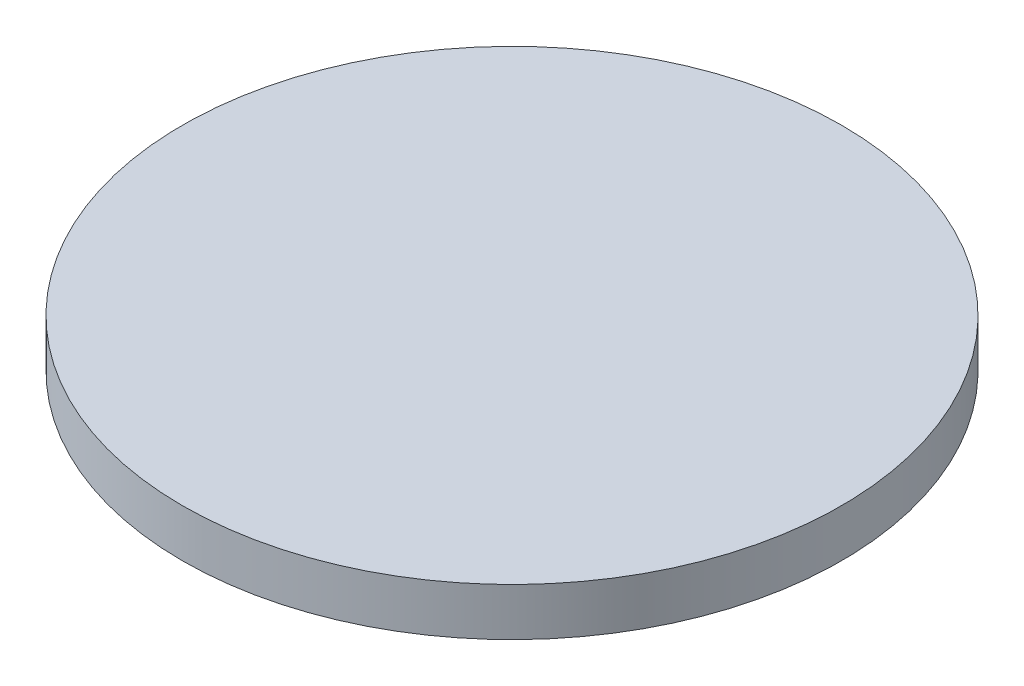
ISO-10303-21;
HEADER;
FILE_DESCRIPTION(('STEP AP214'),'2;1');
FILE_NAME('part.step','',(''),(''),'','','');
FILE_SCHEMA(('AUTOMOTIVE_DESIGN { 1 0 10303 214 1 1 1 1 }'));
ENDSEC;
DATA;
#1=APPLICATION_CONTEXT('core data for automotive mechanical design processes');
#2=APPLICATION_PROTOCOL_DEFINITION('international standard','automotive_design',2000,#1);
#3=PRODUCT_CONTEXT('',#1,'mechanical');
#4=PRODUCT('Part','Part','',(#3));
#5=PRODUCT_RELATED_PRODUCT_CATEGORY('part','',(#4));
#6=PRODUCT_DEFINITION_FORMATION('','',#4);
#7=PRODUCT_DEFINITION_CONTEXT('part definition',#1,'design');
#8=PRODUCT_DEFINITION('design','',#6,#7);
#9=PRODUCT_DEFINITION_SHAPE('','',#8);
#10=(LENGTH_UNIT() NAMED_UNIT(*) SI_UNIT(.MILLI.,.METRE.));
#11=(NAMED_UNIT(*) PLANE_ANGLE_UNIT() SI_UNIT($,.RADIAN.));
#12=(NAMED_UNIT(*) SI_UNIT($,.STERADIAN.) SOLID_ANGLE_UNIT());
#13=UNCERTAINTY_MEASURE_WITH_UNIT(LENGTH_MEASURE(1.E-05),#10,'distance_accuracy_value','');
#14=(GEOMETRIC_REPRESENTATION_CONTEXT(3) GLOBAL_UNCERTAINTY_ASSIGNED_CONTEXT((#13)) GLOBAL_UNIT_ASSIGNED_CONTEXT((#10,
#11,#12)) REPRESENTATION_CONTEXT('',''));
#15=CARTESIAN_POINT('',(0.,0.,0.));
#16=DIRECTION('',(0.,0.,1.));
#17=DIRECTION('',(1.,0.,0.));
#18=AXIS2_PLACEMENT_3D('',#15,#16,#17);
#19=CARTESIAN_POINT('',(0.,10.,0.));
#20=DIRECTION('',(0.,-1.,0.));
#21=DIRECTION('',(0.,0.,-1.));
#22=AXIS2_PLACEMENT_3D('',#19,#20,#21);
#23=CYLINDRICAL_SURFACE('',#22,69.);
#24=CARTESIAN_POINT('',(0.,10.,0.));
#25=DIRECTION('',(0.,1.,0.));
#26=DIRECTION('',(0.,0.,1.));
#27=AXIS2_PLACEMENT_3D('',#24,#25,#26);
#28=CIRCLE('',#27,69.);
#29=CARTESIAN_POINT('',(0.,10.,69.));
#30=VERTEX_POINT('',#29);
#31=EDGE_CURVE('E10',#30,#30,#28,.T.);
#32=ORIENTED_EDGE('',*,*,#31,.F.);
#33=EDGE_LOOP('',(#32));
#34=FACE_BOUND('',#33,.T.);
#35=CARTESIAN_POINT('',(0.,0.,0.));
#36=DIRECTION('',(0.,1.,0.));
#37=DIRECTION('',(0.,0.,1.));
#38=AXIS2_PLACEMENT_3D('',#35,#36,#37);
#39=CIRCLE('',#38,69.);
#40=CARTESIAN_POINT('',(0.,0.,69.));
#41=VERTEX_POINT('',#40);
#42=EDGE_CURVE('E34',#41,#41,#39,.T.);
#43=ORIENTED_EDGE('',*,*,#42,.T.);
#44=EDGE_LOOP('',(#43));
#45=FACE_BOUND('',#44,.T.);
#46=ADVANCED_FACE('F31',(#34,#45),#23,.T.);
#47=CARTESIAN_POINT('',(0.,10.,0.));
#48=DIRECTION('',(0.,1.,0.));
#49=DIRECTION('',(0.,0.,1.));
#50=AXIS2_PLACEMENT_3D('',#47,#48,#49);
#51=PLANE('',#50);
#52=ORIENTED_EDGE('',*,*,#31,.T.);
#53=EDGE_LOOP('',(#52));
#54=FACE_BOUND('',#53,.T.);
#55=ADVANCED_FACE('F46',(#54),#51,.T.);
#56=CARTESIAN_POINT('',(0.,0.,0.));
#57=DIRECTION('',(0.,1.,0.));
#58=DIRECTION('',(0.,0.,1.));
#59=AXIS2_PLACEMENT_3D('',#56,#57,#58);
#60=PLANE('',#59);
#61=ORIENTED_EDGE('',*,*,#42,.F.);
#62=EDGE_LOOP('',(#61));
#63=FACE_BOUND('',#62,.T.);
#64=ADVANCED_FACE('F44',(#63),#60,.F.);
#65=CLOSED_SHELL('',(#46,#55,#64));
#66=MANIFOLD_SOLID_BREP('B2',#65);
#67=ADVANCED_BREP_SHAPE_REPRESENTATION('',(#18,#66),#14);
#68=SHAPE_DEFINITION_REPRESENTATION(#9,#67);
ENDSEC;
END-ISO-10303-21;
